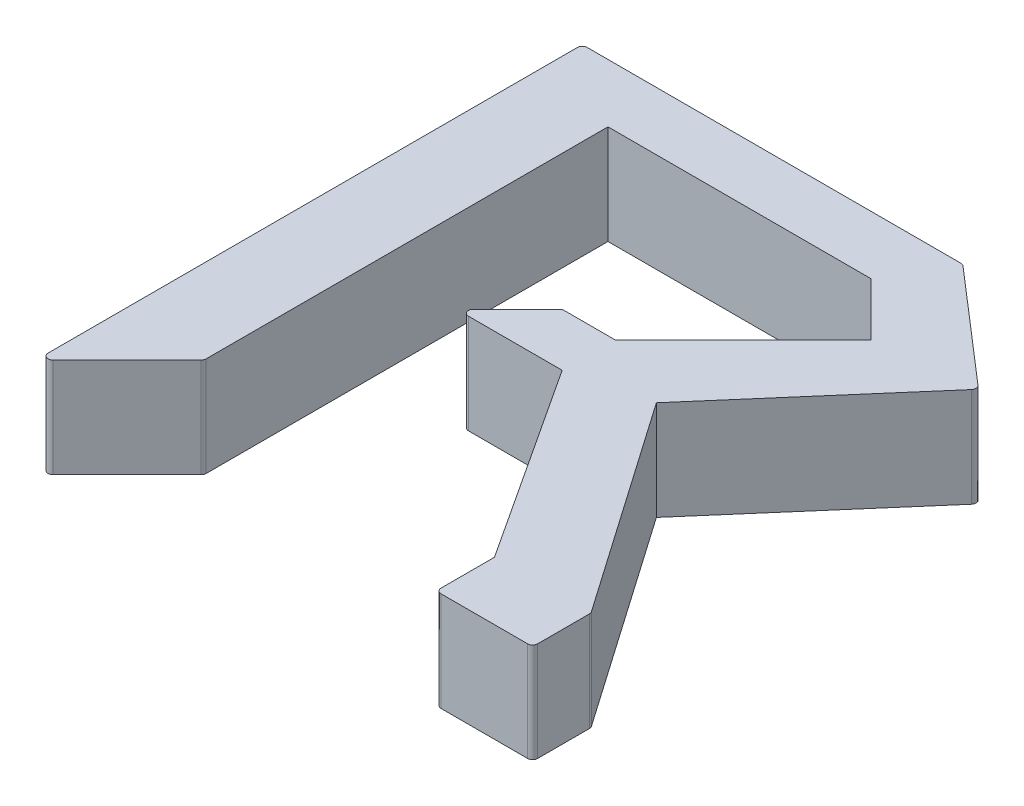
ISO-10303-21;
HEADER;
FILE_DESCRIPTION(('STEP AP214'),'2;1');
FILE_NAME('part.step','',(''),(''),'','','');
FILE_SCHEMA(('AUTOMOTIVE_DESIGN { 1 0 10303 214 1 1 1 1 }'));
ENDSEC;
DATA;
#1=APPLICATION_CONTEXT('core data for automotive mechanical design processes');
#2=APPLICATION_PROTOCOL_DEFINITION('international standard','automotive_design',2000,#1);
#3=PRODUCT_CONTEXT('',#1,'mechanical');
#4=PRODUCT('Part','Part','',(#3));
#5=PRODUCT_RELATED_PRODUCT_CATEGORY('part','',(#4));
#6=PRODUCT_DEFINITION_FORMATION('','',#4);
#7=PRODUCT_DEFINITION_CONTEXT('part definition',#1,'design');
#8=PRODUCT_DEFINITION('design','',#6,#7);
#9=PRODUCT_DEFINITION_SHAPE('','',#8);
#10=(LENGTH_UNIT() NAMED_UNIT(*) SI_UNIT(.MILLI.,.METRE.));
#11=(NAMED_UNIT(*) PLANE_ANGLE_UNIT() SI_UNIT($,.RADIAN.));
#12=(NAMED_UNIT(*) SI_UNIT($,.STERADIAN.) SOLID_ANGLE_UNIT());
#13=UNCERTAINTY_MEASURE_WITH_UNIT(LENGTH_MEASURE(1.E-05),#10,'distance_accuracy_value','');
#14=(GEOMETRIC_REPRESENTATION_CONTEXT(3) GLOBAL_UNCERTAINTY_ASSIGNED_CONTEXT((#13)) GLOBAL_UNIT_ASSIGNED_CONTEXT((#10,
#11,#12)) REPRESENTATION_CONTEXT('',''));
#15=CARTESIAN_POINT('',(0.,0.,0.));
#16=DIRECTION('',(0.,0.,1.));
#17=DIRECTION('',(1.,0.,0.));
#18=AXIS2_PLACEMENT_3D('',#15,#16,#17);
#19=CARTESIAN_POINT('',(0.,10.,0.));
#20=DIRECTION('',(1.,0.,0.));
#21=DIRECTION('',(0.,0.,-1.));
#22=AXIS2_PLACEMENT_3D('',#19,#20,#21);
#23=PLANE('',#22);
#24=DIRECTION('',(0.,0.,1.));
#25=VECTOR('',#24,1.);
#26=CARTESIAN_POINT('',(0.,0.,0.));
#27=LINE('',#26,#25);
#28=CARTESIAN_POINT('',(0.,0.,-54.5));
#29=VERTEX_POINT('',#28);
#30=CARTESIAN_POINT('',(0.,0.,-1.20710678118655));
#31=VERTEX_POINT('',#30);
#32=EDGE_CURVE('E277',#29,#31,#27,.T.);
#33=ORIENTED_EDGE('',*,*,#32,.T.);
#34=DIRECTION('',(0.,-1.,0.));
#35=VECTOR('',#34,1.);
#36=CARTESIAN_POINT('',(0.,10.,-1.20710678118655));
#37=LINE('',#36,#35);
#38=CARTESIAN_POINT('',(0.,10.,-1.20710678118655));
#39=VERTEX_POINT('',#38);
#40=EDGE_CURVE('E399',#31,#39,#37,.F.);
#41=ORIENTED_EDGE('',*,*,#40,.T.);
#42=DIRECTION('',(0.,0.,1.));
#43=VECTOR('',#42,1.);
#44=CARTESIAN_POINT('',(0.,10.,0.));
#45=LINE('',#44,#43);
#46=CARTESIAN_POINT('',(0.,10.,-54.5));
#47=VERTEX_POINT('',#46);
#48=EDGE_CURVE('E319',#47,#39,#45,.T.);
#49=ORIENTED_EDGE('',*,*,#48,.F.);
#50=DIRECTION('',(0.,-1.,0.));
#51=VECTOR('',#50,1.);
#52=CARTESIAN_POINT('',(0.,10.,-54.5));
#53=LINE('',#52,#51);
#54=EDGE_CURVE('E396',#47,#29,#53,.T.);
#55=ORIENTED_EDGE('',*,*,#54,.T.);
#56=EDGE_LOOP('',(#33,#41,#49,#55));
#57=FACE_BOUND('',#56,.T.);
#58=ADVANCED_FACE('F36',(#57),#23,.F.);
#59=CARTESIAN_POINT('',(0.,10.,0.));
#60=DIRECTION('',(-0.707106781186549,0.,-0.707106781186546));
#61=DIRECTION('',(-0.707106781186546,0.,0.707106781186549));
#62=AXIS2_PLACEMENT_3D('',#59,#60,#61);
#63=PLANE('',#62);
#64=DIRECTION('',(0.707106781186546,0.,-0.707106781186549));
#65=VECTOR('',#64,1.);
#66=CARTESIAN_POINT('',(0.,0.,0.));
#67=LINE('',#66,#65);
#68=CARTESIAN_POINT('',(0.853553390593274,0.,-0.853553390593277));
#69=VERTEX_POINT('',#68);
#70=CARTESIAN_POINT('',(8.31509185213173,0.,-8.31509185213176));
#71=VERTEX_POINT('',#70);
#72=EDGE_CURVE('E280',#69,#71,#67,.T.);
#73=ORIENTED_EDGE('',*,*,#72,.T.);
#74=DIRECTION('',(0.,-1.,0.));
#75=VECTOR('',#74,1.);
#76=CARTESIAN_POINT('',(8.31509185213173,10.,-8.31509185213176));
#77=LINE('',#76,#75);
#78=CARTESIAN_POINT('',(8.31509185213173,10.,-8.31509185213176));
#79=VERTEX_POINT('',#78);
#80=EDGE_CURVE('E394',#71,#79,#77,.F.);
#81=ORIENTED_EDGE('',*,*,#80,.T.);
#82=DIRECTION('',(0.707106781186546,0.,-0.707106781186549));
#83=VECTOR('',#82,1.);
#84=CARTESIAN_POINT('',(0.,10.,0.));
#85=LINE('',#84,#83);
#86=CARTESIAN_POINT('',(0.853553390593274,10.,-0.853553390593277));
#87=VERTEX_POINT('',#86);
#88=EDGE_CURVE('E227',#87,#79,#85,.T.);
#89=ORIENTED_EDGE('',*,*,#88,.F.);
#90=DIRECTION('',(0.,-1.,0.));
#91=VECTOR('',#90,1.);
#92=CARTESIAN_POINT('',(0.853553390593274,10.,-0.853553390593277));
#93=LINE('',#92,#91);
#94=EDGE_CURVE('E391',#87,#69,#93,.T.);
#95=ORIENTED_EDGE('',*,*,#94,.T.);
#96=EDGE_LOOP('',(#73,#81,#89,#95));
#97=FACE_BOUND('',#96,.T.);
#98=ADVANCED_FACE('F528',(#97),#63,.F.);
#99=CARTESIAN_POINT('',(8.46153846153846,10.,-8.46153846153849));
#100=DIRECTION('',(-1.,0.,0.));
#101=DIRECTION('',(0.,0.,1.));
#102=AXIS2_PLACEMENT_3D('',#99,#100,#101);
#103=PLANE('',#102);
#104=DIRECTION('',(0.,0.,-1.));
#105=VECTOR('',#104,1.);
#106=CARTESIAN_POINT('',(8.46153846153846,10.,-8.46153846153849));
#107=LINE('',#106,#105);
#108=CARTESIAN_POINT('',(8.46153846153846,10.,-8.66864524272503));
#109=VERTEX_POINT('',#108);
#110=CARTESIAN_POINT('',(8.46153846153846,10.,-49.1239316239316));
#111=VERTEX_POINT('',#110);
#112=EDGE_CURVE('E214',#109,#111,#107,.T.);
#113=ORIENTED_EDGE('',*,*,#112,.F.);
#114=DIRECTION('',(0.,-1.,0.));
#115=VECTOR('',#114,1.);
#116=CARTESIAN_POINT('',(8.46153846153846,10.,-8.66864524272503));
#117=LINE('',#116,#115);
#118=CARTESIAN_POINT('',(8.46153846153846,0.,-8.66864524272503));
#119=VERTEX_POINT('',#118);
#120=EDGE_CURVE('E389',#109,#119,#117,.T.);
#121=ORIENTED_EDGE('',*,*,#120,.T.);
#122=DIRECTION('',(0.,0.,-1.));
#123=VECTOR('',#122,1.);
#124=CARTESIAN_POINT('',(8.46153846153846,0.,-8.46153846153849));
#125=LINE('',#124,#123);
#126=CARTESIAN_POINT('',(8.46153846153846,0.,-49.1239316239316));
#127=VERTEX_POINT('',#126);
#128=EDGE_CURVE('E233',#119,#127,#125,.T.);
#129=ORIENTED_EDGE('',*,*,#128,.T.);
#130=DIRECTION('',(0.,-1.,0.));
#131=VECTOR('',#130,1.);
#132=CARTESIAN_POINT('',(8.46153846153846,10.,-49.1239316239316));
#133=LINE('',#132,#131);
#134=EDGE_CURVE('E230',#111,#127,#133,.T.);
#135=ORIENTED_EDGE('',*,*,#134,.F.);
#136=EDGE_LOOP('',(#113,#121,#129,#135));
#137=FACE_BOUND('',#136,.T.);
#138=ADVANCED_FACE('F231',(#137),#103,.F.);
#139=CARTESIAN_POINT('',(8.46153846153846,10.,-49.1239316239316));
#140=DIRECTION('',(0.,0.,-1.));
#141=DIRECTION('',(-1.,0.,0.));
#142=AXIS2_PLACEMENT_3D('',#139,#140,#141);
#143=PLANE('',#142);
#144=DIRECTION('',(1.,0.,0.));
#145=VECTOR('',#144,1.);
#146=CARTESIAN_POINT('',(8.46153846153846,0.,-49.1239316239316));
#147=LINE('',#146,#145);
#148=CARTESIAN_POINT('',(34.9598431225488,0.,-49.1239316239316));
#149=VERTEX_POINT('',#148);
#150=EDGE_CURVE('E284',#127,#149,#147,.T.);
#151=ORIENTED_EDGE('',*,*,#150,.T.);
#152=DIRECTION('',(0.,-1.,0.));
#153=VECTOR('',#152,1.);
#154=CARTESIAN_POINT('',(34.9598431225488,10.,-49.1239316239316));
#155=LINE('',#154,#153);
#156=CARTESIAN_POINT('',(34.9598431225488,10.,-49.1239316239316));
#157=VERTEX_POINT('',#156);
#158=EDGE_CURVE('E237',#157,#149,#155,.T.);
#159=ORIENTED_EDGE('',*,*,#158,.F.);
#160=DIRECTION('',(1.,0.,0.));
#161=VECTOR('',#160,1.);
#162=CARTESIAN_POINT('',(8.46153846153846,10.,-49.1239316239316));
#163=LINE('',#162,#161);
#164=EDGE_CURVE('E219',#111,#157,#163,.T.);
#165=ORIENTED_EDGE('',*,*,#164,.F.);
#166=ORIENTED_EDGE('',*,*,#134,.T.);
#167=EDGE_LOOP('',(#151,#159,#165,#166));
#168=FACE_BOUND('',#167,.T.);
#169=ADVANCED_FACE('F239',(#168),#143,.F.);
#170=CARTESIAN_POINT('',(34.9598431225488,10.,-49.1239316239316));
#171=DIRECTION('',(0.707106781186546,0.,-0.707106781186549));
#172=DIRECTION('',(-0.707106781186549,0.,-0.707106781186546));
#173=AXIS2_PLACEMENT_3D('',#170,#171,#172);
#174=PLANE('',#173);
#175=DIRECTION('',(0.707106781186549,0.,0.707106781186546));
#176=VECTOR('',#175,1.);
#177=CARTESIAN_POINT('',(34.9598431225488,0.,-49.1239316239316));
#178=LINE('',#177,#176);
#179=CARTESIAN_POINT('',(40.2790668604197,0.,-43.8047078860607));
#180=VERTEX_POINT('',#179);
#181=EDGE_CURVE('E286',#149,#180,#178,.T.);
#182=ORIENTED_EDGE('',*,*,#181,.T.);
#183=DIRECTION('',(0.,-1.,0.));
#184=VECTOR('',#183,1.);
#185=CARTESIAN_POINT('',(40.2790668604197,10.,-43.8047078860607));
#186=LINE('',#185,#184);
#187=CARTESIAN_POINT('',(40.2790668604197,10.,-43.8047078860607));
#188=VERTEX_POINT('',#187);
#189=EDGE_CURVE('E331',#188,#180,#186,.T.);
#190=ORIENTED_EDGE('',*,*,#189,.F.);
#191=DIRECTION('',(0.707106781186549,0.,0.707106781186546));
#192=VECTOR('',#191,1.);
#193=CARTESIAN_POINT('',(34.9598431225488,10.,-49.1239316239316));
#194=LINE('',#193,#192);
#195=EDGE_CURVE('E242',#157,#188,#194,.T.);
#196=ORIENTED_EDGE('',*,*,#195,.F.);
#197=ORIENTED_EDGE('',*,*,#158,.T.);
#198=EDGE_LOOP('',(#182,#190,#196,#197));
#199=FACE_BOUND('',#198,.T.);
#200=ADVANCED_FACE('F466',(#199),#174,.F.);
#201=CARTESIAN_POINT('',(40.2790668604197,10.,-43.8047078860607));
#202=DIRECTION('',(0.707106781186549,0.,0.707106781186546));
#203=DIRECTION('',(0.707106781186546,0.,-0.707106781186549));
#204=AXIS2_PLACEMENT_3D('',#201,#202,#203);
#205=PLANE('',#204);
#206=DIRECTION('',(-0.707106781186546,0.,0.707106781186549));
#207=VECTOR('',#206,1.);
#208=CARTESIAN_POINT('',(40.2790668604197,0.,-43.8047078860607));
#209=LINE('',#208,#207);
#210=CARTESIAN_POINT('',(27.3824786324787,0.,-30.9081196581196));
#211=VERTEX_POINT('',#210);
#212=EDGE_CURVE('E288',#180,#211,#209,.T.);
#213=ORIENTED_EDGE('',*,*,#212,.T.);
#214=DIRECTION('',(0.,-1.,0.));
#215=VECTOR('',#214,1.);
#216=CARTESIAN_POINT('',(27.3824786324787,10.,-30.9081196581196));
#217=LINE('',#216,#215);
#218=CARTESIAN_POINT('',(27.3824786324787,10.,-30.9081196581196));
#219=VERTEX_POINT('',#218);
#220=EDGE_CURVE('E328',#219,#211,#217,.T.);
#221=ORIENTED_EDGE('',*,*,#220,.F.);
#222=DIRECTION('',(-0.707106781186546,0.,0.707106781186549));
#223=VECTOR('',#222,1.);
#224=CARTESIAN_POINT('',(40.2790668604197,10.,-43.8047078860607));
#225=LINE('',#224,#223);
#226=EDGE_CURVE('E244',#188,#219,#225,.T.);
#227=ORIENTED_EDGE('',*,*,#226,.F.);
#228=ORIENTED_EDGE('',*,*,#189,.T.);
#229=EDGE_LOOP('',(#213,#221,#227,#228));
#230=FACE_BOUND('',#229,.T.);
#231=ADVANCED_FACE('F473',(#230),#205,.F.);
#232=CARTESIAN_POINT('',(27.3824786324787,10.,-30.9081196581196));
#233=DIRECTION('',(0.,0.,1.));
#234=DIRECTION('',(1.,0.,0.));
#235=AXIS2_PLACEMENT_3D('',#232,#233,#234);
#236=PLANE('',#235);
#237=DIRECTION('',(-1.,0.,0.));
#238=VECTOR('',#237,1.);
#239=CARTESIAN_POINT('',(27.3824786324787,0.,-30.9081196581196));
#240=LINE('',#239,#238);
#241=CARTESIAN_POINT('',(22.2703616757943,0.,-30.9081196581196));
#242=VERTEX_POINT('',#241);
#243=EDGE_CURVE('E290',#211,#242,#240,.T.);
#244=ORIENTED_EDGE('',*,*,#243,.T.);
#245=DIRECTION('',(0.,-1.,0.));
#246=VECTOR('',#245,1.);
#247=CARTESIAN_POINT('',(22.2703616757943,10.,-30.9081196581196));
#248=LINE('',#247,#246);
#249=CARTESIAN_POINT('',(22.2703616757943,10.,-30.9081196581196));
#250=VERTEX_POINT('',#249);
#251=EDGE_CURVE('E384',#242,#250,#248,.F.);
#252=ORIENTED_EDGE('',*,*,#251,.T.);
#253=DIRECTION('',(-1.,0.,0.));
#254=VECTOR('',#253,1.);
#255=CARTESIAN_POINT('',(27.3824786324787,10.,-30.9081196581196));
#256=LINE('',#255,#254);
#257=EDGE_CURVE('E249',#219,#250,#256,.T.);
#258=ORIENTED_EDGE('',*,*,#257,.F.);
#259=ORIENTED_EDGE('',*,*,#220,.T.);
#260=EDGE_LOOP('',(#244,#252,#258,#259));
#261=FACE_BOUND('',#260,.T.);
#262=ADVANCED_FACE('F476',(#261),#236,.F.);
#263=CARTESIAN_POINT('',(16.7440311567369,10.,-25.5888959202487));
#264=DIRECTION('',(0.707106781186549,0.,0.707106781186546));
#265=DIRECTION('',(0.707106781186546,0.,-0.707106781186549));
#266=AXIS2_PLACEMENT_3D('',#263,#264,#265);
#267=PLANE('',#266);
#268=DIRECTION('',(-0.707106781186546,0.,0.707106781186549));
#269=VECTOR('',#268,1.);
#270=CARTESIAN_POINT('',(16.7440311567369,10.,-25.5888959202487));
#271=LINE('',#270,#269);
#272=CARTESIAN_POINT('',(21.916808285201,10.,-30.7616730487129));
#273=VERTEX_POINT('',#272);
#274=CARTESIAN_POINT('',(17.5975845473301,10.,-26.442449310842));
#275=VERTEX_POINT('',#274);
#276=EDGE_CURVE('E252',#273,#275,#271,.T.);
#277=ORIENTED_EDGE('',*,*,#276,.F.);
#278=DIRECTION('',(0.,-1.,0.));
#279=VECTOR('',#278,1.);
#280=CARTESIAN_POINT('',(21.916808285201,10.,-30.7616730487129));
#281=LINE('',#280,#279);
#282=CARTESIAN_POINT('',(21.916808285201,0.,-30.7616730487129));
#283=VERTEX_POINT('',#282);
#284=EDGE_CURVE('E381',#273,#283,#281,.T.);
#285=ORIENTED_EDGE('',*,*,#284,.T.);
#286=DIRECTION('',(-0.707106781186546,0.,0.707106781186549));
#287=VECTOR('',#286,1.);
#288=CARTESIAN_POINT('',(16.7440311567369,0.,-25.5888959202487));
#289=LINE('',#288,#287);
#290=CARTESIAN_POINT('',(17.5975845473301,0.,-26.442449310842));
#291=VERTEX_POINT('',#290);
#292=EDGE_CURVE('E293',#283,#291,#289,.T.);
#293=ORIENTED_EDGE('',*,*,#292,.T.);
#294=DIRECTION('',(0.,-1.,0.));
#295=VECTOR('',#294,1.);
#296=CARTESIAN_POINT('',(17.5975845473301,10.,-26.442449310842));
#297=LINE('',#296,#295);
#298=EDGE_CURVE('E379',#291,#275,#297,.F.);
#299=ORIENTED_EDGE('',*,*,#298,.T.);
#300=EDGE_LOOP('',(#277,#285,#293,#299));
#301=FACE_BOUND('',#300,.T.);
#302=ADVANCED_FACE('F484',(#301),#267,.F.);
#303=CARTESIAN_POINT('',(16.7440311567369,10.,-25.5888959202487));
#304=DIRECTION('',(0.,0.,-1.));
#305=DIRECTION('',(-1.,0.,0.));
#306=AXIS2_PLACEMENT_3D('',#303,#304,#305);
#307=PLANE('',#306);
#308=DIRECTION('',(1.,0.,0.));
#309=VECTOR('',#308,1.);
#310=CARTESIAN_POINT('',(16.7440311567369,10.,-25.5888959202487));
#311=LINE('',#310,#309);
#312=CARTESIAN_POINT('',(17.9511379379234,10.,-25.5888959202487));
#313=VERTEX_POINT('',#312);
#314=CARTESIAN_POINT('',(27.3824786324787,10.,-25.5888959202487));
#315=VERTEX_POINT('',#314);
#316=EDGE_CURVE('E255',#313,#315,#311,.T.);
#317=ORIENTED_EDGE('',*,*,#316,.F.);
#318=DIRECTION('',(0.,-1.,0.));
#319=VECTOR('',#318,1.);
#320=CARTESIAN_POINT('',(17.9511379379234,10.,-25.5888959202487));
#321=LINE('',#320,#319);
#322=CARTESIAN_POINT('',(17.9511379379234,0.,-25.5888959202487));
#323=VERTEX_POINT('',#322);
#324=EDGE_CURVE('E386',#313,#323,#321,.T.);
#325=ORIENTED_EDGE('',*,*,#324,.T.);
#326=DIRECTION('',(1.,0.,0.));
#327=VECTOR('',#326,1.);
#328=CARTESIAN_POINT('',(16.7440311567369,0.,-25.5888959202487));
#329=LINE('',#328,#327);
#330=CARTESIAN_POINT('',(27.3824786324787,0.,-25.5888959202487));
#331=VERTEX_POINT('',#330);
#332=EDGE_CURVE('E296',#323,#331,#329,.T.);
#333=ORIENTED_EDGE('',*,*,#332,.T.);
#334=DIRECTION('',(0.,-1.,0.));
#335=VECTOR('',#334,1.);
#336=CARTESIAN_POINT('',(27.3824786324787,10.,-25.5888959202487));
#337=LINE('',#336,#335);
#338=EDGE_CURVE('E325',#315,#331,#337,.T.);
#339=ORIENTED_EDGE('',*,*,#338,.F.);
#340=EDGE_LOOP('',(#317,#325,#333,#339));
#341=FACE_BOUND('',#340,.T.);
#342=ADVANCED_FACE('F493',(#341),#307,.F.);
#343=CARTESIAN_POINT('',(27.3824786324787,10.,-25.5888959202487));
#344=DIRECTION('',(0.836825083344378,0.,-0.547470346124495));
#345=DIRECTION('',(-0.547470346124495,0.,-0.836825083344378));
#346=AXIS2_PLACEMENT_3D('',#343,#344,#345);
#347=PLANE('',#346);
#348=DIRECTION('',(0.547470346124495,0.,0.836825083344378));
#349=VECTOR('',#348,1.);
#350=CARTESIAN_POINT('',(27.3824786324787,0.,-25.5888959202487));
#351=LINE('',#350,#349);
#352=CARTESIAN_POINT('',(40.2790668604197,0.,-5.87606837606838));
#353=VERTEX_POINT('',#352);
#354=EDGE_CURVE('E298',#331,#353,#351,.T.);
#355=ORIENTED_EDGE('',*,*,#354,.T.);
#356=DIRECTION('',(0.,-1.,0.));
#357=VECTOR('',#356,1.);
#358=CARTESIAN_POINT('',(40.2790668604197,10.,-5.87606837606838));
#359=LINE('',#358,#357);
#360=CARTESIAN_POINT('',(40.2790668604197,10.,-5.87606837606838));
#361=VERTEX_POINT('',#360);
#362=EDGE_CURVE('E322',#361,#353,#359,.T.);
#363=ORIENTED_EDGE('',*,*,#362,.F.);
#364=DIRECTION('',(0.547470346124495,0.,0.836825083344378));
#365=VECTOR('',#364,1.);
#366=CARTESIAN_POINT('',(27.3824786324787,10.,-25.5888959202487));
#367=LINE('',#366,#365);
#368=EDGE_CURVE('E257',#315,#361,#367,.T.);
#369=ORIENTED_EDGE('',*,*,#368,.F.);
#370=ORIENTED_EDGE('',*,*,#338,.T.);
#371=EDGE_LOOP('',(#355,#363,#369,#370));
#372=FACE_BOUND('',#371,.T.);
#373=ADVANCED_FACE('F499',(#372),#347,.F.);
#374=CARTESIAN_POINT('',(40.2790668604197,10.,-5.87606837606838));
#375=DIRECTION('',(1.,0.,0.));
#376=DIRECTION('',(0.,0.,-1.));
#377=AXIS2_PLACEMENT_3D('',#374,#375,#376);
#378=PLANE('',#377);
#379=DIRECTION('',(0.,0.,1.));
#380=VECTOR('',#379,1.);
#381=CARTESIAN_POINT('',(40.2790668604197,0.,-5.87606837606838));
#382=LINE('',#381,#380);
#383=CARTESIAN_POINT('',(40.2790668604197,0.,-0.5));
#384=VERTEX_POINT('',#383);
#385=EDGE_CURVE('E300',#353,#384,#382,.T.);
#386=ORIENTED_EDGE('',*,*,#385,.T.);
#387=DIRECTION('',(0.,-1.,0.));
#388=VECTOR('',#387,1.);
#389=CARTESIAN_POINT('',(40.2790668604197,10.,-0.5));
#390=LINE('',#389,#388);
#391=CARTESIAN_POINT('',(40.2790668604197,10.,-0.5));
#392=VERTEX_POINT('',#391);
#393=EDGE_CURVE('E359',#384,#392,#390,.F.);
#394=ORIENTED_EDGE('',*,*,#393,.T.);
#395=DIRECTION('',(0.,0.,1.));
#396=VECTOR('',#395,1.);
#397=CARTESIAN_POINT('',(40.2790668604197,10.,-5.87606837606838));
#398=LINE('',#397,#396);
#399=EDGE_CURVE('E259',#361,#392,#398,.T.);
#400=ORIENTED_EDGE('',*,*,#399,.F.);
#401=ORIENTED_EDGE('',*,*,#362,.T.);
#402=EDGE_LOOP('',(#386,#394,#400,#401));
#403=FACE_BOUND('',#402,.T.);
#404=ADVANCED_FACE('F659',(#403),#378,.F.);
#405=CARTESIAN_POINT('',(40.2790668604197,10.,0.));
#406=DIRECTION('',(0.,0.,-1.));
#407=DIRECTION('',(-1.,0.,0.));
#408=AXIS2_PLACEMENT_3D('',#405,#406,#407);
#409=PLANE('',#408);
#410=DIRECTION('',(1.,0.,0.));
#411=VECTOR('',#410,1.);
#412=CARTESIAN_POINT('',(40.2790668604197,10.,0.));
#413=LINE('',#412,#411);
#414=CARTESIAN_POINT('',(40.7790668604197,10.,0.));
#415=VERTEX_POINT('',#414);
#416=CARTESIAN_POINT('',(49.5,10.,0.));
#417=VERTEX_POINT('',#416);
#418=EDGE_CURVE('E261',#415,#417,#413,.T.);
#419=ORIENTED_EDGE('',*,*,#418,.F.);
#420=DIRECTION('',(0.,-1.,0.));
#421=VECTOR('',#420,1.);
#422=CARTESIAN_POINT('',(40.7790668604197,10.,0.));
#423=LINE('',#422,#421);
#424=CARTESIAN_POINT('',(40.7790668604197,0.,0.));
#425=VERTEX_POINT('',#424);
#426=EDGE_CURVE('E336',#415,#425,#423,.T.);
#427=ORIENTED_EDGE('',*,*,#426,.T.);
#428=DIRECTION('',(1.,0.,0.));
#429=VECTOR('',#428,1.);
#430=CARTESIAN_POINT('',(40.2790668604197,0.,0.));
#431=LINE('',#430,#429);
#432=CARTESIAN_POINT('',(49.5,0.,0.));
#433=VERTEX_POINT('',#432);
#434=EDGE_CURVE('E303',#425,#433,#431,.T.);
#435=ORIENTED_EDGE('',*,*,#434,.T.);
#436=DIRECTION('',(0.,-1.,0.));
#437=VECTOR('',#436,1.);
#438=CARTESIAN_POINT('',(49.5,10.,0.));
#439=LINE('',#438,#437);
#440=EDGE_CURVE('E236',#433,#417,#439,.F.);
#441=ORIENTED_EDGE('',*,*,#440,.T.);
#442=EDGE_LOOP('',(#419,#427,#435,#441));
#443=FACE_BOUND('',#442,.T.);
#444=ADVANCED_FACE('F509',(#443),#409,.F.);
#445=CARTESIAN_POINT('',(50.,10.,0.));
#446=DIRECTION('',(-1.,0.,0.));
#447=DIRECTION('',(0.,0.,1.));
#448=AXIS2_PLACEMENT_3D('',#445,#446,#447);
#449=PLANE('',#448);
#450=DIRECTION('',(0.,0.,-1.));
#451=VECTOR('',#450,1.);
#452=CARTESIAN_POINT('',(50.,10.,0.));
#453=LINE('',#452,#451);
#454=CARTESIAN_POINT('',(50.,10.,-0.5));
#455=VERTEX_POINT('',#454);
#456=CARTESIAN_POINT('',(50.,10.,-5.71928258113582));
#457=VERTEX_POINT('',#456);
#458=EDGE_CURVE('E264',#455,#457,#453,.T.);
#459=ORIENTED_EDGE('',*,*,#458,.F.);
#460=DIRECTION('',(0.,-1.,0.));
#461=VECTOR('',#460,1.);
#462=CARTESIAN_POINT('',(50.,10.,-0.5));
#463=LINE('',#462,#461);
#464=CARTESIAN_POINT('',(50.,0.,-0.5));
#465=VERTEX_POINT('',#464);
#466=EDGE_CURVE('E412',#455,#465,#463,.T.);
#467=ORIENTED_EDGE('',*,*,#466,.T.);
#468=DIRECTION('',(0.,0.,-1.));
#469=VECTOR('',#468,1.);
#470=CARTESIAN_POINT('',(50.,0.,0.));
#471=LINE('',#470,#469);
#472=CARTESIAN_POINT('',(50.,0.,-5.71928258113582));
#473=VERTEX_POINT('',#472);
#474=EDGE_CURVE('E306',#465,#473,#471,.T.);
#475=ORIENTED_EDGE('',*,*,#474,.T.);
#476=DIRECTION('',(0.,-1.,0.));
#477=VECTOR('',#476,1.);
#478=CARTESIAN_POINT('',(50.,10.,-5.71928258113582));
#479=LINE('',#478,#477);
#480=EDGE_CURVE('E410',#473,#457,#479,.F.);
#481=ORIENTED_EDGE('',*,*,#480,.T.);
#482=EDGE_LOOP('',(#459,#467,#475,#481));
#483=FACE_BOUND('',#482,.T.);
#484=ADVANCED_FACE('F518',(#483),#449,.F.);
#485=CARTESIAN_POINT('',(34.9598431225488,10.,-27.5));
#486=DIRECTION('',(-0.820951084220427,0.,0.570998526545652));
#487=DIRECTION('',(0.570998526545652,0.,0.820951084220427));
#488=AXIS2_PLACEMENT_3D('',#485,#486,#487);
#489=PLANE('',#488);
#490=DIRECTION('',(-0.570998526545652,0.,-0.820951084220427));
#491=VECTOR('',#490,1.);
#492=CARTESIAN_POINT('',(34.9598431225488,10.,-27.5));
#493=LINE('',#492,#491);
#494=CARTESIAN_POINT('',(49.9104755421102,10.,-6.00478184440865));
#495=VERTEX_POINT('',#494);
#496=CARTESIAN_POINT('',(34.9598431225488,10.,-27.5));
#497=VERTEX_POINT('',#496);
#498=EDGE_CURVE('E267',#495,#497,#493,.T.);
#499=ORIENTED_EDGE('',*,*,#498,.F.);
#500=DIRECTION('',(0.,-1.,0.));
#501=VECTOR('',#500,1.);
#502=CARTESIAN_POINT('',(49.9104755421102,10.,-6.00478184440865));
#503=LINE('',#502,#501);
#504=CARTESIAN_POINT('',(49.9104755421102,0.,-6.00478184440865));
#505=VERTEX_POINT('',#504);
#506=EDGE_CURVE('E44',#495,#505,#503,.T.);
#507=ORIENTED_EDGE('',*,*,#506,.T.);
#508=DIRECTION('',(-0.570998526545652,0.,-0.820951084220427));
#509=VECTOR('',#508,1.);
#510=CARTESIAN_POINT('',(34.9598431225488,0.,-27.5));
#511=LINE('',#510,#509);
#512=CARTESIAN_POINT('',(34.9598431225488,0.,-27.5));
#513=VERTEX_POINT('',#512);
#514=EDGE_CURVE('E309',#505,#513,#511,.T.);
#515=ORIENTED_EDGE('',*,*,#514,.T.);
#516=DIRECTION('',(0.,-1.,0.));
#517=VECTOR('',#516,1.);
#518=CARTESIAN_POINT('',(34.9598431225488,10.,-27.5));
#519=LINE('',#518,#517);
#520=EDGE_CURVE('E276',#497,#513,#519,.T.);
#521=ORIENTED_EDGE('',*,*,#520,.F.);
#522=EDGE_LOOP('',(#499,#507,#515,#521));
#523=FACE_BOUND('',#522,.T.);
#524=ADVANCED_FACE('F419',(#523),#489,.F.);
#525=CARTESIAN_POINT('',(50.,10.,-44.8931623931624));
#526=DIRECTION('',(-0.756418645514361,0.,-0.654087786706203));
#527=DIRECTION('',(-0.654087786706203,0.,0.756418645514361));
#528=AXIS2_PLACEMENT_3D('',#525,#526,#527);
#529=PLANE('',#528);
#530=DIRECTION('',(0.654087786706203,0.,-0.756418645514361));
#531=VECTOR('',#530,1.);
#532=CARTESIAN_POINT('',(50.,0.,-44.8931623931624));
#533=LINE('',#532,#531);
#534=CARTESIAN_POINT('',(49.6729561066469,0.,-44.5149530704052));
#535=VERTEX_POINT('',#534);
#536=EDGE_CURVE('E311',#513,#535,#533,.T.);
#537=ORIENTED_EDGE('',*,*,#536,.T.);
#538=DIRECTION('',(0.,-1.,0.));
#539=VECTOR('',#538,1.);
#540=CARTESIAN_POINT('',(49.6729561066469,10.,-44.5149530704052));
#541=LINE('',#540,#539);
#542=CARTESIAN_POINT('',(49.6729561066469,10.,-44.5149530704052));
#543=VERTEX_POINT('',#542);
#544=EDGE_CURVE('E11',#535,#543,#541,.F.);
#545=ORIENTED_EDGE('',*,*,#544,.T.);
#546=DIRECTION('',(0.654087786706203,0.,-0.756418645514361));
#547=VECTOR('',#546,1.);
#548=CARTESIAN_POINT('',(50.,10.,-44.8931623931624));
#549=LINE('',#548,#547);
#550=EDGE_CURVE('E269',#497,#543,#549,.T.);
#551=ORIENTED_EDGE('',*,*,#550,.F.);
#552=ORIENTED_EDGE('',*,*,#520,.T.);
#553=EDGE_LOOP('',(#537,#545,#551,#552));
#554=FACE_BOUND('',#553,.T.);
#555=ADVANCED_FACE('F431',(#554),#529,.F.);
#556=CARTESIAN_POINT('',(38.3119658119658,10.,-55.));
#557=DIRECTION('',(-0.654087786706203,0.,0.756418645514361));
#558=DIRECTION('',(0.756418645514361,0.,0.654087786706203));
#559=AXIS2_PLACEMENT_3D('',#556,#557,#558);
#560=PLANE('',#559);
#561=DIRECTION('',(-0.756418645514361,0.,-0.654087786706203));
#562=VECTOR('',#561,1.);
#563=CARTESIAN_POINT('',(38.3119658119658,0.,-55.));
#564=LINE('',#563,#562);
#565=CARTESIAN_POINT('',(49.6217906772428,0.,-45.2202062865155));
#566=VERTEX_POINT('',#565);
#567=CARTESIAN_POINT('',(38.4528104218006,0.,-54.8782093227572));
#568=VERTEX_POINT('',#567);
#569=EDGE_CURVE('E314',#566,#568,#564,.T.);
#570=ORIENTED_EDGE('',*,*,#569,.T.);
#571=DIRECTION('',(0.,-1.,0.));
#572=VECTOR('',#571,1.);
#573=CARTESIAN_POINT('',(38.4528104218006,10.,-54.8782093227572));
#574=LINE('',#573,#572);
#575=CARTESIAN_POINT('',(38.4528104218006,10.,-54.8782093227572));
#576=VERTEX_POINT('',#575);
#577=EDGE_CURVE('E408',#568,#576,#574,.F.);
#578=ORIENTED_EDGE('',*,*,#577,.T.);
#579=DIRECTION('',(-0.756418645514361,0.,-0.654087786706203));
#580=VECTOR('',#579,1.);
#581=CARTESIAN_POINT('',(38.3119658119658,10.,-55.));
#582=LINE('',#581,#580);
#583=CARTESIAN_POINT('',(49.6217906772428,10.,-45.2202062865155));
#584=VERTEX_POINT('',#583);
#585=EDGE_CURVE('E272',#584,#576,#582,.T.);
#586=ORIENTED_EDGE('',*,*,#585,.F.);
#587=DIRECTION('',(0.,-1.,0.));
#588=VECTOR('',#587,1.);
#589=CARTESIAN_POINT('',(49.6217906772428,10.,-45.2202062865155));
#590=LINE('',#589,#588);
#591=EDGE_CURVE('E405',#584,#566,#590,.T.);
#592=ORIENTED_EDGE('',*,*,#591,.T.);
#593=EDGE_LOOP('',(#570,#578,#586,#592));
#594=FACE_BOUND('',#593,.T.);
#595=ADVANCED_FACE('F438',(#594),#560,.F.);
#596=CARTESIAN_POINT('',(0.,10.,-55.));
#597=DIRECTION('',(0.,0.,1.));
#598=DIRECTION('',(1.,0.,0.));
#599=AXIS2_PLACEMENT_3D('',#596,#597,#598);
#600=PLANE('',#599);
#601=DIRECTION('',(-1.,0.,0.));
#602=VECTOR('',#601,1.);
#603=CARTESIAN_POINT('',(0.,0.,-55.));
#604=LINE('',#603,#602);
#605=CARTESIAN_POINT('',(38.1257665284475,0.,-55.));
#606=VERTEX_POINT('',#605);
#607=CARTESIAN_POINT('',(0.5,0.,-55.));
#608=VERTEX_POINT('',#607);
#609=EDGE_CURVE('E317',#606,#608,#604,.T.);
#610=ORIENTED_EDGE('',*,*,#609,.T.);
#611=DIRECTION('',(0.,-1.,0.));
#612=VECTOR('',#611,1.);
#613=CARTESIAN_POINT('',(0.5,10.,-55.));
#614=LINE('',#613,#612);
#615=CARTESIAN_POINT('',(0.5,10.,-55.));
#616=VERTEX_POINT('',#615);
#617=EDGE_CURVE('E51',#608,#616,#614,.F.);
#618=ORIENTED_EDGE('',*,*,#617,.T.);
#619=DIRECTION('',(-1.,0.,0.));
#620=VECTOR('',#619,1.);
#621=CARTESIAN_POINT('',(0.,10.,-55.));
#622=LINE('',#621,#620);
#623=CARTESIAN_POINT('',(38.1257665284475,10.,-55.));
#624=VERTEX_POINT('',#623);
#625=EDGE_CURVE('E274',#624,#616,#622,.T.);
#626=ORIENTED_EDGE('',*,*,#625,.F.);
#627=DIRECTION('',(0.,-1.,0.));
#628=VECTOR('',#627,1.);
#629=CARTESIAN_POINT('',(38.1257665284475,10.,-55.));
#630=LINE('',#629,#628);
#631=EDGE_CURVE('E401',#624,#606,#630,.T.);
#632=ORIENTED_EDGE('',*,*,#631,.T.);
#633=EDGE_LOOP('',(#610,#618,#626,#632));
#634=FACE_BOUND('',#633,.T.);
#635=ADVANCED_FACE('F444',(#634),#600,.F.);
#636=CARTESIAN_POINT('',(0.,10.,0.));
#637=DIRECTION('',(0.,-1.,0.));
#638=DIRECTION('',(0.,0.,-1.));
#639=AXIS2_PLACEMENT_3D('',#636,#637,#638);
#640=PLANE('',#639);
#641=ORIENTED_EDGE('',*,*,#399,.T.);
#642=CARTESIAN_POINT('',(40.7790668604197,10.,-0.5));
#643=DIRECTION('',(0.,-1.,0.));
#644=DIRECTION('',(0.,0.,-1.));
#645=AXIS2_PLACEMENT_3D('',#642,#643,#644);
#646=CIRCLE('',#645,0.5);
#647=EDGE_CURVE('E377',#392,#415,#646,.F.);
#648=ORIENTED_EDGE('',*,*,#647,.T.);
#649=ORIENTED_EDGE('',*,*,#418,.T.);
#650=CARTESIAN_POINT('',(49.5,10.,-0.5));
#651=DIRECTION('',(0.,-1.,0.));
#652=DIRECTION('',(0.,0.,-1.));
#653=AXIS2_PLACEMENT_3D('',#650,#651,#652);
#654=CIRCLE('',#653,0.5);
#655=EDGE_CURVE('E365',#417,#455,#654,.F.);
#656=ORIENTED_EDGE('',*,*,#655,.T.);
#657=ORIENTED_EDGE('',*,*,#458,.T.);
#658=CARTESIAN_POINT('',(49.5,10.,-5.71928258113582));
#659=DIRECTION('',(0.,-1.,0.));
#660=DIRECTION('',(0.,0.,-1.));
#661=AXIS2_PLACEMENT_3D('',#658,#659,#660);
#662=CIRCLE('',#661,0.5);
#663=EDGE_CURVE('E363',#457,#495,#662,.F.);
#664=ORIENTED_EDGE('',*,*,#663,.T.);
#665=ORIENTED_EDGE('',*,*,#498,.T.);
#666=ORIENTED_EDGE('',*,*,#550,.T.);
#667=CARTESIAN_POINT('',(49.2947467838897,10.,-44.8419969637583));
#668=DIRECTION('',(0.,-1.,0.));
#669=DIRECTION('',(0.,0.,-1.));
#670=AXIS2_PLACEMENT_3D('',#667,#668,#669);
#671=CIRCLE('',#670,0.5);
#672=EDGE_CURVE('E361',#543,#584,#671,.F.);
#673=ORIENTED_EDGE('',*,*,#672,.T.);
#674=ORIENTED_EDGE('',*,*,#585,.T.);
#675=CARTESIAN_POINT('',(38.1257665284475,10.,-54.5));
#676=DIRECTION('',(0.,-1.,0.));
#677=DIRECTION('',(0.,0.,-1.));
#678=AXIS2_PLACEMENT_3D('',#675,#676,#677);
#679=CIRCLE('',#678,0.5);
#680=EDGE_CURVE('E58',#576,#624,#679,.F.);
#681=ORIENTED_EDGE('',*,*,#680,.T.);
#682=ORIENTED_EDGE('',*,*,#625,.T.);
#683=CARTESIAN_POINT('',(0.5,10.,-54.5));
#684=DIRECTION('',(0.,-1.,0.));
#685=DIRECTION('',(0.,0.,-1.));
#686=AXIS2_PLACEMENT_3D('',#683,#684,#685);
#687=CIRCLE('',#686,0.5);
#688=EDGE_CURVE('E368',#616,#47,#687,.F.);
#689=ORIENTED_EDGE('',*,*,#688,.T.);
#690=ORIENTED_EDGE('',*,*,#48,.T.);
#691=CARTESIAN_POINT('',(0.5,10.,-1.20710678118655));
#692=DIRECTION('',(0.,-1.,0.));
#693=DIRECTION('',(0.,0.,-1.));
#694=AXIS2_PLACEMENT_3D('',#691,#692,#693);
#695=CIRCLE('',#694,0.5);
#696=EDGE_CURVE('E370',#39,#87,#695,.F.);
#697=ORIENTED_EDGE('',*,*,#696,.T.);
#698=ORIENTED_EDGE('',*,*,#88,.T.);
#699=CARTESIAN_POINT('',(7.96153846153846,10.,-8.66864524272503));
#700=DIRECTION('',(0.,-1.,0.));
#701=DIRECTION('',(0.,0.,-1.));
#702=AXIS2_PLACEMENT_3D('',#699,#700,#701);
#703=CIRCLE('',#702,0.5);
#704=EDGE_CURVE('E223',#79,#109,#703,.F.);
#705=ORIENTED_EDGE('',*,*,#704,.T.);
#706=ORIENTED_EDGE('',*,*,#112,.T.);
#707=ORIENTED_EDGE('',*,*,#164,.T.);
#708=ORIENTED_EDGE('',*,*,#195,.T.);
#709=ORIENTED_EDGE('',*,*,#226,.T.);
#710=ORIENTED_EDGE('',*,*,#257,.T.);
#711=CARTESIAN_POINT('',(22.2703616757943,10.,-30.4081196581196));
#712=DIRECTION('',(0.,-1.,0.));
#713=DIRECTION('',(0.,0.,-1.));
#714=AXIS2_PLACEMENT_3D('',#711,#712,#713);
#715=CIRCLE('',#714,0.5);
#716=EDGE_CURVE('E375',#250,#273,#715,.F.);
#717=ORIENTED_EDGE('',*,*,#716,.T.);
#718=ORIENTED_EDGE('',*,*,#276,.T.);
#719=CARTESIAN_POINT('',(17.9511379379234,10.,-26.0888959202487));
#720=DIRECTION('',(0.,-1.,0.));
#721=DIRECTION('',(0.,0.,-1.));
#722=AXIS2_PLACEMENT_3D('',#719,#720,#721);
#723=CIRCLE('',#722,0.5);
#724=EDGE_CURVE('E373',#275,#313,#723,.F.);
#725=ORIENTED_EDGE('',*,*,#724,.T.);
#726=ORIENTED_EDGE('',*,*,#316,.T.);
#727=ORIENTED_EDGE('',*,*,#368,.T.);
#728=EDGE_LOOP('',(#641,#648,#649,#656,#657,#664,#665,#666,#673,#674,#681,#682,#689,#690,#697,
#698,#705,#706,#707,#708,#709,#710,#717,#718,#725,#726,#727));
#729=FACE_BOUND('',#728,.T.);
#730=ADVANCED_FACE('F217',(#729),#640,.F.);
#731=CARTESIAN_POINT('',(0.,0.,0.));
#732=DIRECTION('',(0.,-1.,0.));
#733=DIRECTION('',(0.,0.,-1.));
#734=AXIS2_PLACEMENT_3D('',#731,#732,#733);
#735=PLANE('',#734);
#736=ORIENTED_EDGE('',*,*,#434,.F.);
#737=CARTESIAN_POINT('',(40.7790668604197,0.,-0.5));
#738=DIRECTION('',(0.,-1.,0.));
#739=DIRECTION('',(0.,0.,-1.));
#740=AXIS2_PLACEMENT_3D('',#737,#738,#739);
#741=CIRCLE('',#740,0.5);
#742=EDGE_CURVE('E357',#425,#384,#741,.T.);
#743=ORIENTED_EDGE('',*,*,#742,.T.);
#744=ORIENTED_EDGE('',*,*,#385,.F.);
#745=ORIENTED_EDGE('',*,*,#354,.F.);
#746=ORIENTED_EDGE('',*,*,#332,.F.);
#747=CARTESIAN_POINT('',(17.9511379379234,0.,-26.0888959202487));
#748=DIRECTION('',(0.,-1.,0.));
#749=DIRECTION('',(0.,0.,-1.));
#750=AXIS2_PLACEMENT_3D('',#747,#748,#749);
#751=CIRCLE('',#750,0.5);
#752=EDGE_CURVE('E353',#323,#291,#751,.T.);
#753=ORIENTED_EDGE('',*,*,#752,.T.);
#754=ORIENTED_EDGE('',*,*,#292,.F.);
#755=CARTESIAN_POINT('',(22.2703616757943,0.,-30.4081196581196));
#756=DIRECTION('',(0.,-1.,0.));
#757=DIRECTION('',(0.,0.,-1.));
#758=AXIS2_PLACEMENT_3D('',#755,#756,#757);
#759=CIRCLE('',#758,0.5);
#760=EDGE_CURVE('E355',#283,#242,#759,.T.);
#761=ORIENTED_EDGE('',*,*,#760,.T.);
#762=ORIENTED_EDGE('',*,*,#243,.F.);
#763=ORIENTED_EDGE('',*,*,#212,.F.);
#764=ORIENTED_EDGE('',*,*,#181,.F.);
#765=ORIENTED_EDGE('',*,*,#150,.F.);
#766=ORIENTED_EDGE('',*,*,#128,.F.);
#767=CARTESIAN_POINT('',(7.96153846153846,0.,-8.66864524272503));
#768=DIRECTION('',(0.,-1.,0.));
#769=DIRECTION('',(0.,0.,-1.));
#770=AXIS2_PLACEMENT_3D('',#767,#768,#769);
#771=CIRCLE('',#770,0.5);
#772=EDGE_CURVE('E351',#119,#71,#771,.T.);
#773=ORIENTED_EDGE('',*,*,#772,.T.);
#774=ORIENTED_EDGE('',*,*,#72,.F.);
#775=CARTESIAN_POINT('',(0.5,0.,-1.20710678118655));
#776=DIRECTION('',(0.,-1.,0.));
#777=DIRECTION('',(0.,0.,-1.));
#778=AXIS2_PLACEMENT_3D('',#775,#776,#777);
#779=CIRCLE('',#778,0.5);
#780=EDGE_CURVE('E349',#69,#31,#779,.T.);
#781=ORIENTED_EDGE('',*,*,#780,.T.);
#782=ORIENTED_EDGE('',*,*,#32,.F.);
#783=CARTESIAN_POINT('',(0.5,0.,-54.5));
#784=DIRECTION('',(0.,-1.,0.));
#785=DIRECTION('',(0.,0.,-1.));
#786=AXIS2_PLACEMENT_3D('',#783,#784,#785);
#787=CIRCLE('',#786,0.5);
#788=EDGE_CURVE('E347',#29,#608,#787,.T.);
#789=ORIENTED_EDGE('',*,*,#788,.T.);
#790=ORIENTED_EDGE('',*,*,#609,.F.);
#791=CARTESIAN_POINT('',(38.1257665284475,0.,-54.5));
#792=DIRECTION('',(0.,-1.,0.));
#793=DIRECTION('',(0.,0.,-1.));
#794=AXIS2_PLACEMENT_3D('',#791,#792,#793);
#795=CIRCLE('',#794,0.5);
#796=EDGE_CURVE('E345',#606,#568,#795,.T.);
#797=ORIENTED_EDGE('',*,*,#796,.T.);
#798=ORIENTED_EDGE('',*,*,#569,.F.);
#799=CARTESIAN_POINT('',(49.2947467838897,0.,-44.8419969637583));
#800=DIRECTION('',(0.,-1.,0.));
#801=DIRECTION('',(0.,0.,-1.));
#802=AXIS2_PLACEMENT_3D('',#799,#800,#801);
#803=CIRCLE('',#802,0.5);
#804=EDGE_CURVE('E339',#566,#535,#803,.T.);
#805=ORIENTED_EDGE('',*,*,#804,.T.);
#806=ORIENTED_EDGE('',*,*,#536,.F.);
#807=ORIENTED_EDGE('',*,*,#514,.F.);
#808=CARTESIAN_POINT('',(49.5,0.,-5.71928258113582));
#809=DIRECTION('',(0.,-1.,0.));
#810=DIRECTION('',(0.,0.,-1.));
#811=AXIS2_PLACEMENT_3D('',#808,#809,#810);
#812=CIRCLE('',#811,0.5);
#813=EDGE_CURVE('E341',#505,#473,#812,.T.);
#814=ORIENTED_EDGE('',*,*,#813,.T.);
#815=ORIENTED_EDGE('',*,*,#474,.F.);
#816=CARTESIAN_POINT('',(49.5,0.,-0.5));
#817=DIRECTION('',(0.,-1.,0.));
#818=DIRECTION('',(0.,0.,-1.));
#819=AXIS2_PLACEMENT_3D('',#816,#817,#818);
#820=CIRCLE('',#819,0.5);
#821=EDGE_CURVE('E343',#465,#433,#820,.T.);
#822=ORIENTED_EDGE('',*,*,#821,.T.);
#823=EDGE_LOOP('',(#736,#743,#744,#745,#746,#753,#754,#761,#762,#763,#764,#765,#766,#773,#774,
#781,#782,#789,#790,#797,#798,#805,#806,#807,#814,#815,#822));
#824=FACE_BOUND('',#823,.T.);
#825=ADVANCED_FACE('F426',(#824),#735,.T.);
#826=CARTESIAN_POINT('',(40.7790668604197,10.,-0.5));
#827=DIRECTION('',(0.,-1.,0.));
#828=DIRECTION('',(0.,0.,-1.));
#829=AXIS2_PLACEMENT_3D('',#826,#827,#828);
#830=CYLINDRICAL_SURFACE('',#829,0.5);
#831=ORIENTED_EDGE('',*,*,#647,.F.);
#832=ORIENTED_EDGE('',*,*,#393,.F.);
#833=ORIENTED_EDGE('',*,*,#742,.F.);
#834=ORIENTED_EDGE('',*,*,#426,.F.);
#835=EDGE_LOOP('',(#831,#832,#833,#834));
#836=FACE_BOUND('',#835,.T.);
#837=ADVANCED_FACE('F507',(#836),#830,.T.);
#838=CARTESIAN_POINT('',(22.2703616757943,10.,-30.4081196581196));
#839=DIRECTION('',(0.,-1.,0.));
#840=DIRECTION('',(0.,0.,-1.));
#841=AXIS2_PLACEMENT_3D('',#838,#839,#840);
#842=CYLINDRICAL_SURFACE('',#841,0.5);
#843=ORIENTED_EDGE('',*,*,#716,.F.);
#844=ORIENTED_EDGE('',*,*,#251,.F.);
#845=ORIENTED_EDGE('',*,*,#760,.F.);
#846=ORIENTED_EDGE('',*,*,#284,.F.);
#847=EDGE_LOOP('',(#843,#844,#845,#846));
#848=FACE_BOUND('',#847,.T.);
#849=ADVANCED_FACE('F479',(#848),#842,.T.);
#850=CARTESIAN_POINT('',(17.9511379379234,10.,-26.0888959202487));
#851=DIRECTION('',(0.,-1.,0.));
#852=DIRECTION('',(0.,0.,-1.));
#853=AXIS2_PLACEMENT_3D('',#850,#851,#852);
#854=CYLINDRICAL_SURFACE('',#853,0.5);
#855=ORIENTED_EDGE('',*,*,#724,.F.);
#856=ORIENTED_EDGE('',*,*,#298,.F.);
#857=ORIENTED_EDGE('',*,*,#752,.F.);
#858=ORIENTED_EDGE('',*,*,#324,.F.);
#859=EDGE_LOOP('',(#855,#856,#857,#858));
#860=FACE_BOUND('',#859,.T.);
#861=ADVANCED_FACE('F488',(#860),#854,.T.);
#862=CARTESIAN_POINT('',(7.96153846153846,10.,-8.66864524272503));
#863=DIRECTION('',(0.,-1.,0.));
#864=DIRECTION('',(0.,0.,-1.));
#865=AXIS2_PLACEMENT_3D('',#862,#863,#864);
#866=CYLINDRICAL_SURFACE('',#865,0.5);
#867=ORIENTED_EDGE('',*,*,#704,.F.);
#868=ORIENTED_EDGE('',*,*,#80,.F.);
#869=ORIENTED_EDGE('',*,*,#772,.F.);
#870=ORIENTED_EDGE('',*,*,#120,.F.);
#871=EDGE_LOOP('',(#867,#868,#869,#870));
#872=FACE_BOUND('',#871,.T.);
#873=ADVANCED_FACE('F461',(#872),#866,.T.);
#874=CARTESIAN_POINT('',(0.5,10.,-1.20710678118655));
#875=DIRECTION('',(0.,-1.,0.));
#876=DIRECTION('',(0.,0.,-1.));
#877=AXIS2_PLACEMENT_3D('',#874,#875,#876);
#878=CYLINDRICAL_SURFACE('',#877,0.5);
#879=ORIENTED_EDGE('',*,*,#696,.F.);
#880=ORIENTED_EDGE('',*,*,#40,.F.);
#881=ORIENTED_EDGE('',*,*,#780,.F.);
#882=ORIENTED_EDGE('',*,*,#94,.F.);
#883=EDGE_LOOP('',(#879,#880,#881,#882));
#884=FACE_BOUND('',#883,.T.);
#885=ADVANCED_FACE('F544',(#884),#878,.T.);
#886=CARTESIAN_POINT('',(0.5,10.,-54.5));
#887=DIRECTION('',(0.,-1.,0.));
#888=DIRECTION('',(0.,0.,-1.));
#889=AXIS2_PLACEMENT_3D('',#886,#887,#888);
#890=CYLINDRICAL_SURFACE('',#889,0.5);
#891=ORIENTED_EDGE('',*,*,#688,.F.);
#892=ORIENTED_EDGE('',*,*,#617,.F.);
#893=ORIENTED_EDGE('',*,*,#788,.F.);
#894=ORIENTED_EDGE('',*,*,#54,.F.);
#895=EDGE_LOOP('',(#891,#892,#893,#894));
#896=FACE_BOUND('',#895,.T.);
#897=ADVANCED_FACE('F449',(#896),#890,.T.);
#898=CARTESIAN_POINT('',(38.1257665284475,10.,-54.5));
#899=DIRECTION('',(0.,-1.,0.));
#900=DIRECTION('',(0.,0.,-1.));
#901=AXIS2_PLACEMENT_3D('',#898,#899,#900);
#902=CYLINDRICAL_SURFACE('',#901,0.5);
#903=ORIENTED_EDGE('',*,*,#680,.F.);
#904=ORIENTED_EDGE('',*,*,#577,.F.);
#905=ORIENTED_EDGE('',*,*,#796,.F.);
#906=ORIENTED_EDGE('',*,*,#631,.F.);
#907=EDGE_LOOP('',(#903,#904,#905,#906));
#908=FACE_BOUND('',#907,.T.);
#909=ADVANCED_FACE('F441',(#908),#902,.T.);
#910=CARTESIAN_POINT('',(49.5,10.,-0.5));
#911=DIRECTION('',(0.,-1.,0.));
#912=DIRECTION('',(0.,0.,-1.));
#913=AXIS2_PLACEMENT_3D('',#910,#911,#912);
#914=CYLINDRICAL_SURFACE('',#913,0.5);
#915=ORIENTED_EDGE('',*,*,#655,.F.);
#916=ORIENTED_EDGE('',*,*,#440,.F.);
#917=ORIENTED_EDGE('',*,*,#821,.F.);
#918=ORIENTED_EDGE('',*,*,#466,.F.);
#919=EDGE_LOOP('',(#915,#916,#917,#918));
#920=FACE_BOUND('',#919,.T.);
#921=ADVANCED_FACE('F515',(#920),#914,.T.);
#922=CARTESIAN_POINT('',(49.5,10.,-5.71928258113582));
#923=DIRECTION('',(0.,-1.,0.));
#924=DIRECTION('',(0.,0.,-1.));
#925=AXIS2_PLACEMENT_3D('',#922,#923,#924);
#926=CYLINDRICAL_SURFACE('',#925,0.5);
#927=ORIENTED_EDGE('',*,*,#663,.F.);
#928=ORIENTED_EDGE('',*,*,#480,.F.);
#929=ORIENTED_EDGE('',*,*,#813,.F.);
#930=ORIENTED_EDGE('',*,*,#506,.F.);
#931=EDGE_LOOP('',(#927,#928,#929,#930));
#932=FACE_BOUND('',#931,.T.);
#933=ADVANCED_FACE('F520',(#932),#926,.T.);
#934=CARTESIAN_POINT('',(49.2947467838897,10.,-44.8419969637583));
#935=DIRECTION('',(0.,-1.,0.));
#936=DIRECTION('',(0.,0.,-1.));
#937=AXIS2_PLACEMENT_3D('',#934,#935,#936);
#938=CYLINDRICAL_SURFACE('',#937,0.5);
#939=ORIENTED_EDGE('',*,*,#672,.F.);
#940=ORIENTED_EDGE('',*,*,#544,.F.);
#941=ORIENTED_EDGE('',*,*,#804,.F.);
#942=ORIENTED_EDGE('',*,*,#591,.F.);
#943=EDGE_LOOP('',(#939,#940,#941,#942));
#944=FACE_BOUND('',#943,.T.);
#945=ADVANCED_FACE('F38',(#944),#938,.T.);
#946=CLOSED_SHELL('',(#58,#98,#138,#169,#200,#231,#262,#302,#342,#373,#404,#444,#484,#524,#555,
#595,#635,#730,#825,#837,#849,#861,#873,#885,#897,#909,#921,#933,#945));
#947=MANIFOLD_SOLID_BREP('B2',#946);
#948=ADVANCED_BREP_SHAPE_REPRESENTATION('',(#18,#947),#14);
#949=SHAPE_DEFINITION_REPRESENTATION(#9,#948);
ENDSEC;
END-ISO-10303-21;
